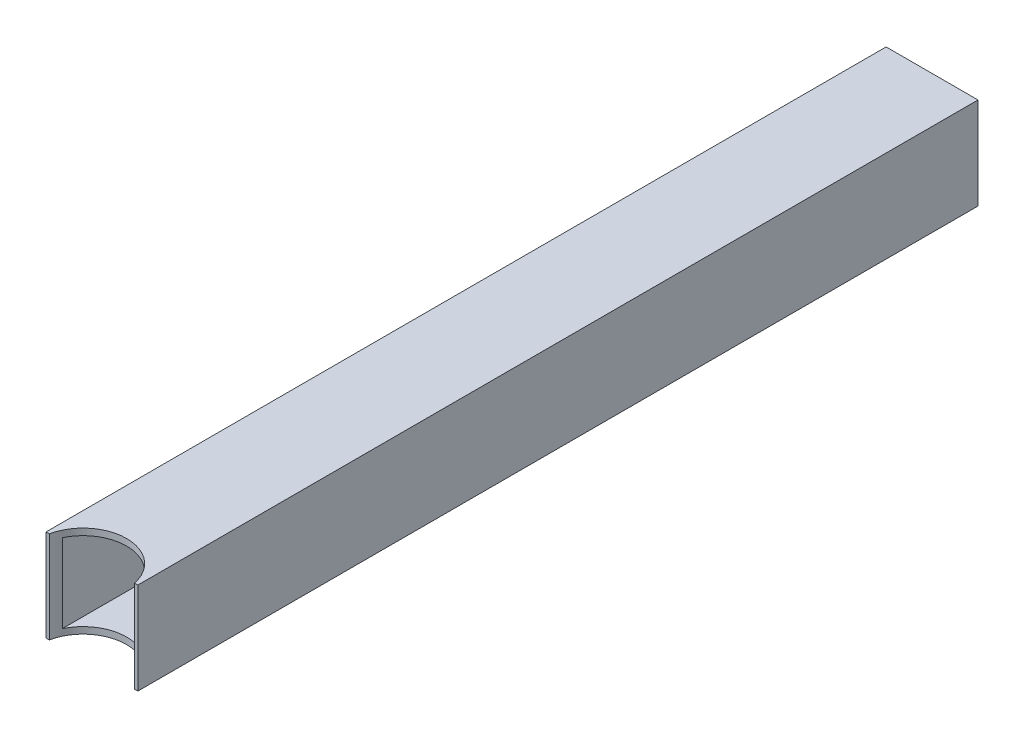
ISO-10303-21;
HEADER;
FILE_DESCRIPTION(('STEP AP214'),'2;1');
FILE_NAME('part.step','',(''),(''),'','','');
FILE_SCHEMA(('AUTOMOTIVE_DESIGN { 1 0 10303 214 1 1 1 1 }'));
ENDSEC;
DATA;
#1=APPLICATION_CONTEXT('core data for automotive mechanical design processes');
#2=APPLICATION_PROTOCOL_DEFINITION('international standard','automotive_design',2000,#1);
#3=PRODUCT_CONTEXT('',#1,'mechanical');
#4=PRODUCT('Part','Part','',(#3));
#5=PRODUCT_RELATED_PRODUCT_CATEGORY('part','',(#4));
#6=PRODUCT_DEFINITION_FORMATION('','',#4);
#7=PRODUCT_DEFINITION_CONTEXT('part definition',#1,'design');
#8=PRODUCT_DEFINITION('design','',#6,#7);
#9=PRODUCT_DEFINITION_SHAPE('','',#8);
#10=(LENGTH_UNIT() NAMED_UNIT(*) SI_UNIT(.MILLI.,.METRE.));
#11=(NAMED_UNIT(*) PLANE_ANGLE_UNIT() SI_UNIT($,.RADIAN.));
#12=(NAMED_UNIT(*) SI_UNIT($,.STERADIAN.) SOLID_ANGLE_UNIT());
#13=UNCERTAINTY_MEASURE_WITH_UNIT(LENGTH_MEASURE(1.E-05),#10,'distance_accuracy_value','');
#14=(GEOMETRIC_REPRESENTATION_CONTEXT(3) GLOBAL_UNCERTAINTY_ASSIGNED_CONTEXT((#13)) GLOBAL_UNIT_ASSIGNED_CONTEXT((#10,
#11,#12)) REPRESENTATION_CONTEXT('',''));
#15=CARTESIAN_POINT('',(0.,0.,0.));
#16=DIRECTION('',(0.,0.,1.));
#17=DIRECTION('',(1.,0.,0.));
#18=AXIS2_PLACEMENT_3D('',#15,#16,#17);
#19=CARTESIAN_POINT('',(22.225,0.,450.85));
#20=DIRECTION('',(0.,0.,1.));
#21=DIRECTION('',(1.,0.,0.));
#22=AXIS2_PLACEMENT_3D('',#19,#20,#21);
#23=PLANE('',#22);
#24=DIRECTION('',(0.,1.,0.));
#25=VECTOR('',#24,1.);
#26=CARTESIAN_POINT('',(0.,-479.425,450.85));
#27=LINE('',#26,#25);
#28=CARTESIAN_POINT('',(0.,-22.225,450.85));
#29=VERTEX_POINT('',#28);
#30=CARTESIAN_POINT('',(0.,22.225,450.85));
#31=VERTEX_POINT('',#30);
#32=EDGE_CURVE('E99',#29,#31,#27,.T.);
#33=ORIENTED_EDGE('',*,*,#32,.F.);
#34=DIRECTION('',(1.,0.,0.));
#35=VECTOR('',#34,1.);
#36=CARTESIAN_POINT('',(22.225,-22.225,450.85));
#37=LINE('',#36,#35);
#38=CARTESIAN_POINT('',(1.58994245222467,-22.225,450.85));
#39=VERTEX_POINT('',#38);
#40=EDGE_CURVE('E148',#29,#39,#37,.T.);
#41=ORIENTED_EDGE('',*,*,#40,.T.);
#42=DIRECTION('',(0.,1.,0.));
#43=VECTOR('',#42,1.);
#44=CARTESIAN_POINT('',(1.58994245222467,22.227,450.85));
#45=LINE('',#44,#43);
#46=CARTESIAN_POINT('',(1.58994245222467,22.225,450.85));
#47=VERTEX_POINT('',#46);
#48=EDGE_CURVE('E150',#39,#47,#45,.T.);
#49=ORIENTED_EDGE('',*,*,#48,.T.);
#50=DIRECTION('',(1.,0.,0.));
#51=VECTOR('',#50,1.);
#52=CARTESIAN_POINT('',(22.225,22.225,450.85));
#53=LINE('',#52,#51);
#54=EDGE_CURVE('E151',#47,#31,#53,.F.);
#55=ORIENTED_EDGE('',*,*,#54,.T.);
#56=EDGE_LOOP('',(#33,#41,#49,#55));
#57=FACE_BOUND('',#56,.T.);
#58=ADVANCED_FACE('F14',(#57),#23,.T.);
#59=CARTESIAN_POINT('',(22.225,22.227,455.168));
#60=DIRECTION('',(0.,1.,0.));
#61=DIRECTION('',(0.,0.,1.));
#62=AXIS2_PLACEMENT_3D('',#59,#60,#61);
#63=CYLINDRICAL_SURFACE('',#62,21.082);
#64=DIRECTION('',(0.,1.,0.));
#65=VECTOR('',#64,1.);
#66=CARTESIAN_POINT('',(41.275,-479.425,446.137594472008));
#67=LINE('',#66,#65);
#68=CARTESIAN_POINT('',(41.275,-19.05,446.137594472008));
#69=VERTEX_POINT('',#68);
#70=CARTESIAN_POINT('',(41.275,19.05,446.137594472008));
#71=VERTEX_POINT('',#70);
#72=EDGE_CURVE('E98',#69,#71,#67,.T.);
#73=ORIENTED_EDGE('',*,*,#72,.F.);
#74=CARTESIAN_POINT('',(22.225,-19.05,455.168));
#75=DIRECTION('',(0.,1.,0.));
#76=DIRECTION('',(0.,0.,1.));
#77=AXIS2_PLACEMENT_3D('',#74,#75,#76);
#78=CIRCLE('',#77,21.082);
#79=CARTESIAN_POINT('',(3.175,-19.05,446.137594472008));
#80=VERTEX_POINT('',#79);
#81=EDGE_CURVE('E111',#80,#69,#78,.F.);
#82=ORIENTED_EDGE('',*,*,#81,.F.);
#83=DIRECTION('',(0.,1.,0.));
#84=VECTOR('',#83,1.);
#85=CARTESIAN_POINT('',(3.175,-479.425,446.137594472008));
#86=LINE('',#85,#84);
#87=CARTESIAN_POINT('',(3.175,19.05,446.137594472008));
#88=VERTEX_POINT('',#87);
#89=EDGE_CURVE('E103',#80,#88,#86,.T.);
#90=ORIENTED_EDGE('',*,*,#89,.T.);
#91=CARTESIAN_POINT('',(22.225,19.05,455.168));
#92=DIRECTION('',(0.,1.,0.));
#93=DIRECTION('',(0.,0.,1.));
#94=AXIS2_PLACEMENT_3D('',#91,#92,#93);
#95=CIRCLE('',#94,21.082);
#96=EDGE_CURVE('E17',#88,#71,#95,.F.);
#97=ORIENTED_EDGE('',*,*,#96,.T.);
#98=EDGE_LOOP('',(#73,#82,#90,#97));
#99=FACE_BOUND('',#98,.T.);
#100=CARTESIAN_POINT('',(22.225,-22.225,455.168));
#101=DIRECTION('',(0.,1.,0.));
#102=DIRECTION('',(0.,0.,1.));
#103=AXIS2_PLACEMENT_3D('',#100,#101,#102);
#104=CIRCLE('',#103,21.082);
#105=CARTESIAN_POINT('',(42.8600575477754,-22.225,450.85));
#106=VERTEX_POINT('',#105);
#107=EDGE_CURVE('E163',#39,#106,#104,.F.);
#108=ORIENTED_EDGE('',*,*,#107,.T.);
#109=DIRECTION('',(0.,1.,0.));
#110=VECTOR('',#109,1.);
#111=CARTESIAN_POINT('',(42.8600575477754,0.,450.85));
#112=LINE('',#111,#110);
#113=CARTESIAN_POINT('',(42.8600575477754,22.225,450.85));
#114=VERTEX_POINT('',#113);
#115=EDGE_CURVE('E177',#114,#106,#112,.F.);
#116=ORIENTED_EDGE('',*,*,#115,.F.);
#117=CARTESIAN_POINT('',(22.225,22.225,455.168));
#118=DIRECTION('',(0.,1.,0.));
#119=DIRECTION('',(0.,0.,1.));
#120=AXIS2_PLACEMENT_3D('',#117,#118,#119);
#121=CIRCLE('',#120,21.082);
#122=EDGE_CURVE('E173',#47,#114,#121,.F.);
#123=ORIENTED_EDGE('',*,*,#122,.F.);
#124=ORIENTED_EDGE('',*,*,#48,.F.);
#125=EDGE_LOOP('',(#108,#116,#123,#124));
#126=FACE_BOUND('',#125,.T.);
#127=ADVANCED_FACE('F109',(#99,#126),#63,.F.);
#128=CARTESIAN_POINT('',(0.,-479.425,450.85));
#129=DIRECTION('',(-1.,0.,0.));
#130=DIRECTION('',(0.,0.,1.));
#131=AXIS2_PLACEMENT_3D('',#128,#129,#130);
#132=PLANE('',#131);
#133=ORIENTED_EDGE('',*,*,#32,.T.);
#134=DIRECTION('',(0.,0.,1.));
#135=VECTOR('',#134,1.);
#136=CARTESIAN_POINT('',(0.,22.225,450.85));
#137=LINE('',#136,#135);
#138=CARTESIAN_POINT('',(0.,22.225,44.45));
#139=VERTEX_POINT('',#138);
#140=EDGE_CURVE('E166',#139,#31,#137,.T.);
#141=ORIENTED_EDGE('',*,*,#140,.F.);
#142=DIRECTION('',(0.,1.,0.));
#143=VECTOR('',#142,1.);
#144=CARTESIAN_POINT('',(0.,0.,44.45));
#145=LINE('',#144,#143);
#146=CARTESIAN_POINT('',(0.,-22.225,44.45));
#147=VERTEX_POINT('',#146);
#148=EDGE_CURVE('E125',#139,#147,#145,.F.);
#149=ORIENTED_EDGE('',*,*,#148,.T.);
#150=DIRECTION('',(0.,0.,1.));
#151=VECTOR('',#150,1.);
#152=CARTESIAN_POINT('',(0.,-22.225,450.85));
#153=LINE('',#152,#151);
#154=EDGE_CURVE('E107',#147,#29,#153,.T.);
#155=ORIENTED_EDGE('',*,*,#154,.T.);
#156=EDGE_LOOP('',(#133,#141,#149,#155));
#157=FACE_BOUND('',#156,.T.);
#158=ADVANCED_FACE('F223',(#157),#132,.T.);
#159=CARTESIAN_POINT('',(22.225,19.05,450.85));
#160=DIRECTION('',(0.,1.,0.));
#161=DIRECTION('',(0.,0.,1.));
#162=AXIS2_PLACEMENT_3D('',#159,#160,#161);
#163=PLANE('',#162);
#164=ORIENTED_EDGE('',*,*,#96,.F.);
#165=DIRECTION('',(0.,0.,1.));
#166=VECTOR('',#165,1.);
#167=CARTESIAN_POINT('',(3.175,19.05,450.85));
#168=LINE('',#167,#166);
#169=CARTESIAN_POINT('',(3.175,19.05,44.45));
#170=VERTEX_POINT('',#169);
#171=EDGE_CURVE('E92',#88,#170,#168,.F.);
#172=ORIENTED_EDGE('',*,*,#171,.T.);
#173=DIRECTION('',(1.,0.,0.));
#174=VECTOR('',#173,1.);
#175=CARTESIAN_POINT('',(22.225,19.05,44.45));
#176=LINE('',#175,#174);
#177=CARTESIAN_POINT('',(41.275,19.05,44.45));
#178=VERTEX_POINT('',#177);
#179=EDGE_CURVE('E122',#170,#178,#176,.T.);
#180=ORIENTED_EDGE('',*,*,#179,.T.);
#181=DIRECTION('',(0.,0.,1.));
#182=VECTOR('',#181,1.);
#183=CARTESIAN_POINT('',(41.275,19.05,450.85));
#184=LINE('',#183,#182);
#185=EDGE_CURVE('E94',#71,#178,#184,.F.);
#186=ORIENTED_EDGE('',*,*,#185,.F.);
#187=EDGE_LOOP('',(#164,#172,#180,#186));
#188=FACE_BOUND('',#187,.T.);
#189=ADVANCED_FACE('F90',(#188),#163,.F.);
#190=CARTESIAN_POINT('',(41.275,-479.425,450.85));
#191=DIRECTION('',(-1.,0.,0.));
#192=DIRECTION('',(0.,0.,1.));
#193=AXIS2_PLACEMENT_3D('',#190,#191,#192);
#194=PLANE('',#193);
#195=DIRECTION('',(0.,1.,0.));
#196=VECTOR('',#195,1.);
#197=CARTESIAN_POINT('',(41.275,0.,44.45));
#198=LINE('',#197,#196);
#199=CARTESIAN_POINT('',(41.275,-19.05,44.45));
#200=VERTEX_POINT('',#199);
#201=EDGE_CURVE('E124',#178,#200,#198,.F.);
#202=ORIENTED_EDGE('',*,*,#201,.T.);
#203=DIRECTION('',(0.,0.,1.));
#204=VECTOR('',#203,1.);
#205=CARTESIAN_POINT('',(41.275,-19.05,450.85));
#206=LINE('',#205,#204);
#207=EDGE_CURVE('E114',#69,#200,#206,.F.);
#208=ORIENTED_EDGE('',*,*,#207,.F.);
#209=ORIENTED_EDGE('',*,*,#72,.T.);
#210=ORIENTED_EDGE('',*,*,#185,.T.);
#211=EDGE_LOOP('',(#202,#208,#209,#210));
#212=FACE_BOUND('',#211,.T.);
#213=ADVANCED_FACE('F289',(#212),#194,.T.);
#214=CARTESIAN_POINT('',(22.225,-19.05,450.85));
#215=DIRECTION('',(0.,1.,0.));
#216=DIRECTION('',(0.,0.,1.));
#217=AXIS2_PLACEMENT_3D('',#214,#215,#216);
#218=PLANE('',#217);
#219=DIRECTION('',(1.,0.,0.));
#220=VECTOR('',#219,1.);
#221=CARTESIAN_POINT('',(22.225,-19.05,44.45));
#222=LINE('',#221,#220);
#223=CARTESIAN_POINT('',(3.175,-19.05,44.45));
#224=VERTEX_POINT('',#223);
#225=EDGE_CURVE('E130',#200,#224,#222,.F.);
#226=ORIENTED_EDGE('',*,*,#225,.T.);
#227=DIRECTION('',(0.,0.,1.));
#228=VECTOR('',#227,1.);
#229=CARTESIAN_POINT('',(3.175,-19.05,450.85));
#230=LINE('',#229,#228);
#231=EDGE_CURVE('E112',#224,#80,#230,.T.);
#232=ORIENTED_EDGE('',*,*,#231,.T.);
#233=ORIENTED_EDGE('',*,*,#81,.T.);
#234=ORIENTED_EDGE('',*,*,#207,.T.);
#235=EDGE_LOOP('',(#226,#232,#233,#234));
#236=FACE_BOUND('',#235,.T.);
#237=ADVANCED_FACE('F280',(#236),#218,.T.);
#238=CARTESIAN_POINT('',(3.175,-479.425,450.85));
#239=DIRECTION('',(-1.,0.,0.));
#240=DIRECTION('',(0.,0.,1.));
#241=AXIS2_PLACEMENT_3D('',#238,#239,#240);
#242=PLANE('',#241);
#243=ORIENTED_EDGE('',*,*,#89,.F.);
#244=ORIENTED_EDGE('',*,*,#231,.F.);
#245=DIRECTION('',(0.,1.,0.));
#246=VECTOR('',#245,1.);
#247=CARTESIAN_POINT('',(3.175,0.,44.45));
#248=LINE('',#247,#246);
#249=EDGE_CURVE('E106',#224,#170,#248,.T.);
#250=ORIENTED_EDGE('',*,*,#249,.T.);
#251=ORIENTED_EDGE('',*,*,#171,.F.);
#252=EDGE_LOOP('',(#243,#244,#250,#251));
#253=FACE_BOUND('',#252,.T.);
#254=ADVANCED_FACE('F102',(#253),#242,.F.);
#255=CARTESIAN_POINT('',(22.225,-22.225,450.85));
#256=DIRECTION('',(0.,1.,0.));
#257=DIRECTION('',(0.,0.,1.));
#258=AXIS2_PLACEMENT_3D('',#255,#256,#257);
#259=PLANE('',#258);
#260=ORIENTED_EDGE('',*,*,#40,.F.);
#261=ORIENTED_EDGE('',*,*,#154,.F.);
#262=DIRECTION('',(1.,0.,0.));
#263=VECTOR('',#262,1.);
#264=CARTESIAN_POINT('',(22.225,-22.225,44.45));
#265=LINE('',#264,#263);
#266=CARTESIAN_POINT('',(44.45,-22.225,44.45));
#267=VERTEX_POINT('',#266);
#268=EDGE_CURVE('E169',#147,#267,#265,.T.);
#269=ORIENTED_EDGE('',*,*,#268,.T.);
#270=DIRECTION('',(0.,0.,1.));
#271=VECTOR('',#270,1.);
#272=CARTESIAN_POINT('',(44.45,-22.225,450.85));
#273=LINE('',#272,#271);
#274=CARTESIAN_POINT('',(44.45,-22.225,450.85));
#275=VERTEX_POINT('',#274);
#276=EDGE_CURVE('E129',#267,#275,#273,.T.);
#277=ORIENTED_EDGE('',*,*,#276,.T.);
#278=DIRECTION('',(1.,0.,0.));
#279=VECTOR('',#278,1.);
#280=CARTESIAN_POINT('',(22.225,-22.225,450.85));
#281=LINE('',#280,#279);
#282=EDGE_CURVE('E175',#106,#275,#281,.T.);
#283=ORIENTED_EDGE('',*,*,#282,.F.);
#284=ORIENTED_EDGE('',*,*,#107,.F.);
#285=EDGE_LOOP('',(#260,#261,#269,#277,#283,#284));
#286=FACE_BOUND('',#285,.T.);
#287=ADVANCED_FACE('F206',(#286),#259,.F.);
#288=CARTESIAN_POINT('',(22.225,0.,450.85));
#289=DIRECTION('',(0.,0.,1.));
#290=DIRECTION('',(1.,0.,0.));
#291=AXIS2_PLACEMENT_3D('',#288,#289,#290);
#292=PLANE('',#291);
#293=DIRECTION('',(0.,1.,0.));
#294=VECTOR('',#293,1.);
#295=CARTESIAN_POINT('',(44.45,-479.425,450.85));
#296=LINE('',#295,#294);
#297=CARTESIAN_POINT('',(44.45,22.225,450.85));
#298=VERTEX_POINT('',#297);
#299=EDGE_CURVE('E191',#275,#298,#296,.T.);
#300=ORIENTED_EDGE('',*,*,#299,.T.);
#301=DIRECTION('',(1.,0.,0.));
#302=VECTOR('',#301,1.);
#303=CARTESIAN_POINT('',(22.225,22.225,450.85));
#304=LINE('',#303,#302);
#305=EDGE_CURVE('E170',#114,#298,#304,.T.);
#306=ORIENTED_EDGE('',*,*,#305,.F.);
#307=ORIENTED_EDGE('',*,*,#115,.T.);
#308=ORIENTED_EDGE('',*,*,#282,.T.);
#309=EDGE_LOOP('',(#300,#306,#307,#308));
#310=FACE_BOUND('',#309,.T.);
#311=ADVANCED_FACE('F215',(#310),#292,.T.);
#312=CARTESIAN_POINT('',(22.225,22.225,450.85));
#313=DIRECTION('',(0.,1.,0.));
#314=DIRECTION('',(0.,0.,1.));
#315=AXIS2_PLACEMENT_3D('',#312,#313,#314);
#316=PLANE('',#315);
#317=DIRECTION('',(1.,0.,0.));
#318=VECTOR('',#317,1.);
#319=CARTESIAN_POINT('',(22.225,22.225,44.45));
#320=LINE('',#319,#318);
#321=CARTESIAN_POINT('',(44.45,22.225,44.45));
#322=VERTEX_POINT('',#321);
#323=EDGE_CURVE('E31',#322,#139,#320,.F.);
#324=ORIENTED_EDGE('',*,*,#323,.T.);
#325=ORIENTED_EDGE('',*,*,#140,.T.);
#326=ORIENTED_EDGE('',*,*,#54,.F.);
#327=ORIENTED_EDGE('',*,*,#122,.T.);
#328=ORIENTED_EDGE('',*,*,#305,.T.);
#329=DIRECTION('',(0.,0.,1.));
#330=VECTOR('',#329,1.);
#331=CARTESIAN_POINT('',(44.45,22.2250000000001,450.85));
#332=LINE('',#331,#330);
#333=EDGE_CURVE('E23',#298,#322,#332,.F.);
#334=ORIENTED_EDGE('',*,*,#333,.T.);
#335=EDGE_LOOP('',(#324,#325,#326,#327,#328,#334));
#336=FACE_BOUND('',#335,.T.);
#337=ADVANCED_FACE('F228',(#336),#316,.T.);
#338=CARTESIAN_POINT('',(22.225,0.,44.45));
#339=DIRECTION('',(0.,0.,1.));
#340=DIRECTION('',(1.,0.,0.));
#341=AXIS2_PLACEMENT_3D('',#338,#339,#340);
#342=PLANE('',#341);
#343=ORIENTED_EDGE('',*,*,#225,.F.);
#344=ORIENTED_EDGE('',*,*,#201,.F.);
#345=ORIENTED_EDGE('',*,*,#179,.F.);
#346=ORIENTED_EDGE('',*,*,#249,.F.);
#347=EDGE_LOOP('',(#343,#344,#345,#346));
#348=FACE_BOUND('',#347,.T.);
#349=ORIENTED_EDGE('',*,*,#323,.F.);
#350=DIRECTION('',(0.,1.,0.));
#351=VECTOR('',#350,1.);
#352=CARTESIAN_POINT('',(44.45,-479.425,44.45));
#353=LINE('',#352,#351);
#354=EDGE_CURVE('E9',#322,#267,#353,.F.);
#355=ORIENTED_EDGE('',*,*,#354,.T.);
#356=ORIENTED_EDGE('',*,*,#268,.F.);
#357=ORIENTED_EDGE('',*,*,#148,.F.);
#358=EDGE_LOOP('',(#349,#355,#356,#357));
#359=FACE_BOUND('',#358,.T.);
#360=ADVANCED_FACE('F230',(#348,#359),#342,.F.);
#361=CARTESIAN_POINT('',(44.45,-479.425,450.85));
#362=DIRECTION('',(-1.,0.,0.));
#363=DIRECTION('',(0.,0.,1.));
#364=AXIS2_PLACEMENT_3D('',#361,#362,#363);
#365=PLANE('',#364);
#366=ORIENTED_EDGE('',*,*,#333,.F.);
#367=ORIENTED_EDGE('',*,*,#299,.F.);
#368=ORIENTED_EDGE('',*,*,#276,.F.);
#369=ORIENTED_EDGE('',*,*,#354,.F.);
#370=EDGE_LOOP('',(#366,#367,#368,#369));
#371=FACE_BOUND('',#370,.T.);
#372=ADVANCED_FACE('F212',(#371),#365,.F.);
#373=CLOSED_SHELL('',(#58,#127,#158,#189,#213,#237,#254,#287,#311,#337,#360,#372));
#374=MANIFOLD_SOLID_BREP('B1',#373);
#375=ADVANCED_BREP_SHAPE_REPRESENTATION('',(#18,#374),#14);
#376=SHAPE_DEFINITION_REPRESENTATION(#9,#375);
ENDSEC;
END-ISO-10303-21;
